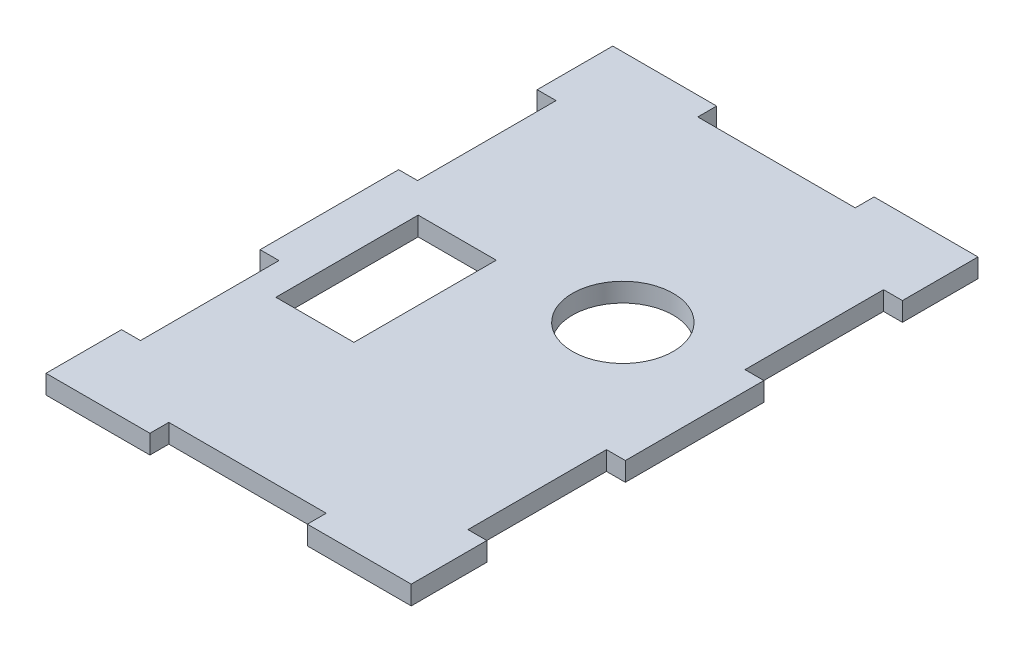
ISO-10303-21;
HEADER;
FILE_DESCRIPTION(('STEP AP214'),'2;1');
FILE_NAME('part.step','',(''),(''),'','','');
FILE_SCHEMA(('AUTOMOTIVE_DESIGN { 1 0 10303 214 1 1 1 1 }'));
ENDSEC;
DATA;
#1=APPLICATION_CONTEXT('core data for automotive mechanical design processes');
#2=APPLICATION_PROTOCOL_DEFINITION('international standard','automotive_design',2000,#1);
#3=PRODUCT_CONTEXT('',#1,'mechanical');
#4=PRODUCT('Part','Part','',(#3));
#5=PRODUCT_RELATED_PRODUCT_CATEGORY('part','',(#4));
#6=PRODUCT_DEFINITION_FORMATION('','',#4);
#7=PRODUCT_DEFINITION_CONTEXT('part definition',#1,'design');
#8=PRODUCT_DEFINITION('design','',#6,#7);
#9=PRODUCT_DEFINITION_SHAPE('','',#8);
#10=(LENGTH_UNIT() NAMED_UNIT(*) SI_UNIT(.MILLI.,.METRE.));
#11=(NAMED_UNIT(*) PLANE_ANGLE_UNIT() SI_UNIT($,.RADIAN.));
#12=(NAMED_UNIT(*) SI_UNIT($,.STERADIAN.) SOLID_ANGLE_UNIT());
#13=UNCERTAINTY_MEASURE_WITH_UNIT(LENGTH_MEASURE(1.E-05),#10,'distance_accuracy_value','');
#14=(GEOMETRIC_REPRESENTATION_CONTEXT(3) GLOBAL_UNCERTAINTY_ASSIGNED_CONTEXT((#13)) GLOBAL_UNIT_ASSIGNED_CONTEXT((#10,
#11,#12)) REPRESENTATION_CONTEXT('',''));
#15=CARTESIAN_POINT('',(0.,0.,0.));
#16=DIRECTION('',(0.,0.,1.));
#17=DIRECTION('',(1.,0.,0.));
#18=AXIS2_PLACEMENT_3D('',#15,#16,#17);
#19=CARTESIAN_POINT('',(0.,3.,0.));
#20=DIRECTION('',(0.,-1.,0.));
#21=DIRECTION('',(0.,0.,-1.));
#22=AXIS2_PLACEMENT_3D('',#19,#20,#21);
#23=PLANE('',#22);
#24=CARTESIAN_POINT('',(12.8024192368406,3.,37.2));
#25=DIRECTION('',(0.,1.,0.));
#26=DIRECTION('',(0.,0.,1.));
#27=AXIS2_PLACEMENT_3D('',#24,#25,#26);
#28=CIRCLE('',#27,8.);
#29=CARTESIAN_POINT('',(12.8024192368406,3.,45.2));
#30=VERTEX_POINT('',#29);
#31=EDGE_CURVE('E278',#30,#30,#28,.T.);
#32=ORIENTED_EDGE('',*,*,#31,.F.);
#33=EDGE_LOOP('',(#32));
#34=FACE_BOUND('',#33,.T.);
#35=DIRECTION('',(1.,0.,0.));
#36=VECTOR('',#35,1.);
#37=CARTESIAN_POINT('',(-26.,3.,12.));
#38=LINE('',#37,#36);
#39=CARTESIAN_POINT('',(-26.,3.,12.));
#40=VERTEX_POINT('',#39);
#41=CARTESIAN_POINT('',(-23.,3.,12.));
#42=VERTEX_POINT('',#41);
#43=EDGE_CURVE('E284',#40,#42,#38,.T.);
#44=ORIENTED_EDGE('',*,*,#43,.T.);
#45=DIRECTION('',(0.,0.,1.));
#46=VECTOR('',#45,1.);
#47=CARTESIAN_POINT('',(-23.,3.,12.));
#48=LINE('',#47,#46);
#49=CARTESIAN_POINT('',(-23.,3.,34.));
#50=VERTEX_POINT('',#49);
#51=EDGE_CURVE('E287',#42,#50,#48,.T.);
#52=ORIENTED_EDGE('',*,*,#51,.T.);
#53=DIRECTION('',(-1.,0.,0.));
#54=VECTOR('',#53,1.);
#55=CARTESIAN_POINT('',(-23.,3.,34.));
#56=LINE('',#55,#54);
#57=CARTESIAN_POINT('',(-26.,3.,34.));
#58=VERTEX_POINT('',#57);
#59=EDGE_CURVE('E290',#50,#58,#56,.T.);
#60=ORIENTED_EDGE('',*,*,#59,.T.);
#61=DIRECTION('',(0.,0.,1.));
#62=VECTOR('',#61,1.);
#63=CARTESIAN_POINT('',(-26.,3.,34.));
#64=LINE('',#63,#62);
#65=CARTESIAN_POINT('',(-26.,3.,56.));
#66=VERTEX_POINT('',#65);
#67=EDGE_CURVE('E292',#58,#66,#64,.T.);
#68=ORIENTED_EDGE('',*,*,#67,.T.);
#69=DIRECTION('',(1.,0.,0.));
#70=VECTOR('',#69,1.);
#71=CARTESIAN_POINT('',(-26.,3.,56.));
#72=LINE('',#71,#70);
#73=CARTESIAN_POINT('',(-23.,3.,56.));
#74=VERTEX_POINT('',#73);
#75=EDGE_CURVE('E294',#66,#74,#72,.T.);
#76=ORIENTED_EDGE('',*,*,#75,.T.);
#77=DIRECTION('',(0.,0.,1.));
#78=VECTOR('',#77,1.);
#79=CARTESIAN_POINT('',(-23.,3.,56.));
#80=LINE('',#79,#78);
#81=CARTESIAN_POINT('',(-23.,3.,78.));
#82=VERTEX_POINT('',#81);
#83=EDGE_CURVE('E296',#74,#82,#80,.T.);
#84=ORIENTED_EDGE('',*,*,#83,.T.);
#85=DIRECTION('',(-1.,0.,0.));
#86=VECTOR('',#85,1.);
#87=CARTESIAN_POINT('',(-23.,3.,78.));
#88=LINE('',#87,#86);
#89=CARTESIAN_POINT('',(-26.,3.,78.));
#90=VERTEX_POINT('',#89);
#91=EDGE_CURVE('E298',#82,#90,#88,.T.);
#92=ORIENTED_EDGE('',*,*,#91,.T.);
#93=DIRECTION('',(0.,0.,1.));
#94=VECTOR('',#93,1.);
#95=CARTESIAN_POINT('',(-26.,3.,78.));
#96=LINE('',#95,#94);
#97=CARTESIAN_POINT('',(-26.,3.,90.));
#98=VERTEX_POINT('',#97);
#99=EDGE_CURVE('E300',#90,#98,#96,.T.);
#100=ORIENTED_EDGE('',*,*,#99,.T.);
#101=DIRECTION('',(1.,0.,0.));
#102=VECTOR('',#101,1.);
#103=CARTESIAN_POINT('',(-26.,3.,90.));
#104=LINE('',#103,#102);
#105=CARTESIAN_POINT('',(-9.49999999999999,3.,90.));
#106=VERTEX_POINT('',#105);
#107=EDGE_CURVE('E302',#98,#106,#104,.T.);
#108=ORIENTED_EDGE('',*,*,#107,.T.);
#109=DIRECTION('',(0.,0.,-1.));
#110=VECTOR('',#109,1.);
#111=CARTESIAN_POINT('',(-9.49999999999999,3.,90.));
#112=LINE('',#111,#110);
#113=CARTESIAN_POINT('',(-9.5,3.,87.));
#114=VERTEX_POINT('',#113);
#115=EDGE_CURVE('E304',#106,#114,#112,.T.);
#116=ORIENTED_EDGE('',*,*,#115,.T.);
#117=DIRECTION('',(1.,0.,0.));
#118=VECTOR('',#117,1.);
#119=CARTESIAN_POINT('',(-9.5,3.,87.));
#120=LINE('',#119,#118);
#121=CARTESIAN_POINT('',(15.5,3.,87.));
#122=VERTEX_POINT('',#121);
#123=EDGE_CURVE('E306',#114,#122,#120,.T.);
#124=ORIENTED_EDGE('',*,*,#123,.T.);
#125=DIRECTION('',(0.,0.,1.));
#126=VECTOR('',#125,1.);
#127=CARTESIAN_POINT('',(15.5,3.,87.));
#128=LINE('',#127,#126);
#129=CARTESIAN_POINT('',(15.5,3.,90.));
#130=VERTEX_POINT('',#129);
#131=EDGE_CURVE('E308',#122,#130,#128,.T.);
#132=ORIENTED_EDGE('',*,*,#131,.T.);
#133=DIRECTION('',(1.,0.,0.));
#134=VECTOR('',#133,1.);
#135=CARTESIAN_POINT('',(15.5,3.,90.));
#136=LINE('',#135,#134);
#137=CARTESIAN_POINT('',(32.,3.,90.));
#138=VERTEX_POINT('',#137);
#139=EDGE_CURVE('E310',#130,#138,#136,.T.);
#140=ORIENTED_EDGE('',*,*,#139,.T.);
#141=DIRECTION('',(0.,0.,-1.));
#142=VECTOR('',#141,1.);
#143=CARTESIAN_POINT('',(32.,3.,78.));
#144=LINE('',#143,#142);
#145=CARTESIAN_POINT('',(32.,3.,78.));
#146=VERTEX_POINT('',#145);
#147=EDGE_CURVE('E312',#138,#146,#144,.T.);
#148=ORIENTED_EDGE('',*,*,#147,.T.);
#149=DIRECTION('',(-1.,0.,0.));
#150=VECTOR('',#149,1.);
#151=CARTESIAN_POINT('',(32.,3.,78.));
#152=LINE('',#151,#150);
#153=CARTESIAN_POINT('',(29.,3.,78.));
#154=VERTEX_POINT('',#153);
#155=EDGE_CURVE('E314',#146,#154,#152,.T.);
#156=ORIENTED_EDGE('',*,*,#155,.T.);
#157=DIRECTION('',(0.,0.,-1.));
#158=VECTOR('',#157,1.);
#159=CARTESIAN_POINT('',(29.,3.,78.));
#160=LINE('',#159,#158);
#161=CARTESIAN_POINT('',(29.,3.,56.));
#162=VERTEX_POINT('',#161);
#163=EDGE_CURVE('E316',#154,#162,#160,.T.);
#164=ORIENTED_EDGE('',*,*,#163,.T.);
#165=DIRECTION('',(1.,0.,0.));
#166=VECTOR('',#165,1.);
#167=CARTESIAN_POINT('',(29.,3.,56.));
#168=LINE('',#167,#166);
#169=CARTESIAN_POINT('',(32.,3.,56.));
#170=VERTEX_POINT('',#169);
#171=EDGE_CURVE('E318',#162,#170,#168,.T.);
#172=ORIENTED_EDGE('',*,*,#171,.T.);
#173=DIRECTION('',(0.,0.,-1.));
#174=VECTOR('',#173,1.);
#175=CARTESIAN_POINT('',(32.,3.,34.));
#176=LINE('',#175,#174);
#177=CARTESIAN_POINT('',(32.,3.,34.));
#178=VERTEX_POINT('',#177);
#179=EDGE_CURVE('E320',#170,#178,#176,.T.);
#180=ORIENTED_EDGE('',*,*,#179,.T.);
#181=DIRECTION('',(-1.,0.,0.));
#182=VECTOR('',#181,1.);
#183=CARTESIAN_POINT('',(29.,3.,34.));
#184=LINE('',#183,#182);
#185=CARTESIAN_POINT('',(29.,3.,34.));
#186=VERTEX_POINT('',#185);
#187=EDGE_CURVE('E322',#178,#186,#184,.T.);
#188=ORIENTED_EDGE('',*,*,#187,.T.);
#189=DIRECTION('',(0.,0.,-1.));
#190=VECTOR('',#189,1.);
#191=CARTESIAN_POINT('',(29.,3.,12.));
#192=LINE('',#191,#190);
#193=CARTESIAN_POINT('',(29.,3.,12.));
#194=VERTEX_POINT('',#193);
#195=EDGE_CURVE('E324',#186,#194,#192,.T.);
#196=ORIENTED_EDGE('',*,*,#195,.T.);
#197=DIRECTION('',(1.,0.,0.));
#198=VECTOR('',#197,1.);
#199=CARTESIAN_POINT('',(32.,3.,12.));
#200=LINE('',#199,#198);
#201=CARTESIAN_POINT('',(32.,3.,12.));
#202=VERTEX_POINT('',#201);
#203=EDGE_CURVE('E326',#194,#202,#200,.T.);
#204=ORIENTED_EDGE('',*,*,#203,.T.);
#205=DIRECTION('',(0.,0.,-1.));
#206=VECTOR('',#205,1.);
#207=CARTESIAN_POINT('',(32.,3.,0.));
#208=LINE('',#207,#206);
#209=CARTESIAN_POINT('',(32.,3.,0.));
#210=VERTEX_POINT('',#209);
#211=EDGE_CURVE('E328',#202,#210,#208,.T.);
#212=ORIENTED_EDGE('',*,*,#211,.T.);
#213=DIRECTION('',(-1.,0.,0.));
#214=VECTOR('',#213,1.);
#215=CARTESIAN_POINT('',(15.5,3.,0.));
#216=LINE('',#215,#214);
#217=CARTESIAN_POINT('',(15.5,3.,0.));
#218=VERTEX_POINT('',#217);
#219=EDGE_CURVE('E330',#210,#218,#216,.T.);
#220=ORIENTED_EDGE('',*,*,#219,.T.);
#221=DIRECTION('',(0.,0.,1.));
#222=VECTOR('',#221,1.);
#223=CARTESIAN_POINT('',(15.5,3.,3.));
#224=LINE('',#223,#222);
#225=CARTESIAN_POINT('',(15.5,3.,3.));
#226=VERTEX_POINT('',#225);
#227=EDGE_CURVE('E332',#218,#226,#224,.T.);
#228=ORIENTED_EDGE('',*,*,#227,.T.);
#229=DIRECTION('',(-1.,0.,0.));
#230=VECTOR('',#229,1.);
#231=CARTESIAN_POINT('',(-9.5,3.,3.));
#232=LINE('',#231,#230);
#233=CARTESIAN_POINT('',(-9.5,3.,3.));
#234=VERTEX_POINT('',#233);
#235=EDGE_CURVE('E334',#226,#234,#232,.T.);
#236=ORIENTED_EDGE('',*,*,#235,.T.);
#237=DIRECTION('',(0.,0.,-1.));
#238=VECTOR('',#237,1.);
#239=CARTESIAN_POINT('',(-9.5,3.,0.));
#240=LINE('',#239,#238);
#241=CARTESIAN_POINT('',(-9.5,3.,0.));
#242=VERTEX_POINT('',#241);
#243=EDGE_CURVE('E336',#234,#242,#240,.T.);
#244=ORIENTED_EDGE('',*,*,#243,.T.);
#245=DIRECTION('',(-1.,0.,0.));
#246=VECTOR('',#245,1.);
#247=CARTESIAN_POINT('',(-26.,3.,0.));
#248=LINE('',#247,#246);
#249=CARTESIAN_POINT('',(-26.,3.,0.));
#250=VERTEX_POINT('',#249);
#251=EDGE_CURVE('E338',#242,#250,#248,.T.);
#252=ORIENTED_EDGE('',*,*,#251,.T.);
#253=DIRECTION('',(0.,0.,1.));
#254=VECTOR('',#253,1.);
#255=CARTESIAN_POINT('',(-26.,3.,0.));
#256=LINE('',#255,#254);
#257=EDGE_CURVE('E340',#250,#40,#256,.T.);
#258=ORIENTED_EDGE('',*,*,#257,.T.);
#259=EDGE_LOOP('',(#44,#52,#60,#68,#76,#84,#92,#100,#108,#116,#124,#132,#140,#148,#156,#164,
#172,#180,#188,#196,#204,#212,#220,#228,#236,#244,#252,#258));
#260=FACE_BOUND('',#259,.T.);
#261=DIRECTION('',(0.,0.,1.));
#262=VECTOR('',#261,1.);
#263=CARTESIAN_POINT('',(-18.2,3.,38.7));
#264=LINE('',#263,#262);
#265=CARTESIAN_POINT('',(-18.2,3.,38.7));
#266=VERTEX_POINT('',#265);
#267=CARTESIAN_POINT('',(-18.2,3.,61.3));
#268=VERTEX_POINT('',#267);
#269=EDGE_CURVE('E242',#266,#268,#264,.T.);
#270=ORIENTED_EDGE('',*,*,#269,.F.);
#271=DIRECTION('',(-1.,0.,0.));
#272=VECTOR('',#271,1.);
#273=CARTESIAN_POINT('',(-5.79999999999999,3.,38.7));
#274=LINE('',#273,#272);
#275=CARTESIAN_POINT('',(-5.79999999999999,3.,38.7));
#276=VERTEX_POINT('',#275);
#277=EDGE_CURVE('E264',#276,#266,#274,.T.);
#278=ORIENTED_EDGE('',*,*,#277,.F.);
#279=DIRECTION('',(0.,0.,-1.));
#280=VECTOR('',#279,1.);
#281=CARTESIAN_POINT('',(-5.79999999999999,3.,61.3));
#282=LINE('',#281,#280);
#283=CARTESIAN_POINT('',(-5.79999999999999,3.,61.3));
#284=VERTEX_POINT('',#283);
#285=EDGE_CURVE('E262',#284,#276,#282,.T.);
#286=ORIENTED_EDGE('',*,*,#285,.F.);
#287=DIRECTION('',(1.,0.,0.));
#288=VECTOR('',#287,1.);
#289=CARTESIAN_POINT('',(-18.2,3.,61.3));
#290=LINE('',#289,#288);
#291=EDGE_CURVE('E250',#268,#284,#290,.T.);
#292=ORIENTED_EDGE('',*,*,#291,.F.);
#293=EDGE_LOOP('',(#270,#278,#286,#292));
#294=FACE_BOUND('',#293,.T.);
#295=ADVANCED_FACE('F33',(#34,#260,#294),#23,.F.);
#296=CARTESIAN_POINT('',(0.,0.,0.));
#297=DIRECTION('',(0.,-1.,0.));
#298=DIRECTION('',(0.,0.,-1.));
#299=AXIS2_PLACEMENT_3D('',#296,#297,#298);
#300=PLANE('',#299);
#301=DIRECTION('',(1.,0.,0.));
#302=VECTOR('',#301,1.);
#303=CARTESIAN_POINT('',(-26.,0.,12.));
#304=LINE('',#303,#302);
#305=CARTESIAN_POINT('',(-26.,0.,12.));
#306=VERTEX_POINT('',#305);
#307=CARTESIAN_POINT('',(-23.,0.,12.));
#308=VERTEX_POINT('',#307);
#309=EDGE_CURVE('E281',#306,#308,#304,.T.);
#310=ORIENTED_EDGE('',*,*,#309,.F.);
#311=DIRECTION('',(0.,0.,1.));
#312=VECTOR('',#311,1.);
#313=CARTESIAN_POINT('',(-26.,0.,0.));
#314=LINE('',#313,#312);
#315=CARTESIAN_POINT('',(-26.,0.,0.));
#316=VERTEX_POINT('',#315);
#317=EDGE_CURVE('E288',#316,#306,#314,.T.);
#318=ORIENTED_EDGE('',*,*,#317,.F.);
#319=DIRECTION('',(-1.,0.,0.));
#320=VECTOR('',#319,1.);
#321=CARTESIAN_POINT('',(-26.,0.,0.));
#322=LINE('',#321,#320);
#323=CARTESIAN_POINT('',(-9.5,0.,0.));
#324=VERTEX_POINT('',#323);
#325=EDGE_CURVE('E395',#324,#316,#322,.T.);
#326=ORIENTED_EDGE('',*,*,#325,.F.);
#327=DIRECTION('',(0.,0.,-1.));
#328=VECTOR('',#327,1.);
#329=CARTESIAN_POINT('',(-9.5,0.,0.));
#330=LINE('',#329,#328);
#331=CARTESIAN_POINT('',(-9.5,0.,3.));
#332=VERTEX_POINT('',#331);
#333=EDGE_CURVE('E393',#332,#324,#330,.T.);
#334=ORIENTED_EDGE('',*,*,#333,.F.);
#335=DIRECTION('',(-1.,0.,0.));
#336=VECTOR('',#335,1.);
#337=CARTESIAN_POINT('',(-9.5,0.,3.));
#338=LINE('',#337,#336);
#339=CARTESIAN_POINT('',(15.5,0.,3.));
#340=VERTEX_POINT('',#339);
#341=EDGE_CURVE('E391',#340,#332,#338,.T.);
#342=ORIENTED_EDGE('',*,*,#341,.F.);
#343=DIRECTION('',(0.,0.,1.));
#344=VECTOR('',#343,1.);
#345=CARTESIAN_POINT('',(15.5,0.,3.));
#346=LINE('',#345,#344);
#347=CARTESIAN_POINT('',(15.5,0.,0.));
#348=VERTEX_POINT('',#347);
#349=EDGE_CURVE('E389',#348,#340,#346,.T.);
#350=ORIENTED_EDGE('',*,*,#349,.F.);
#351=DIRECTION('',(-1.,0.,0.));
#352=VECTOR('',#351,1.);
#353=CARTESIAN_POINT('',(15.5,0.,0.));
#354=LINE('',#353,#352);
#355=CARTESIAN_POINT('',(32.,0.,0.));
#356=VERTEX_POINT('',#355);
#357=EDGE_CURVE('E387',#356,#348,#354,.T.);
#358=ORIENTED_EDGE('',*,*,#357,.F.);
#359=DIRECTION('',(0.,0.,-1.));
#360=VECTOR('',#359,1.);
#361=CARTESIAN_POINT('',(32.,0.,0.));
#362=LINE('',#361,#360);
#363=CARTESIAN_POINT('',(32.,0.,12.));
#364=VERTEX_POINT('',#363);
#365=EDGE_CURVE('E385',#364,#356,#362,.T.);
#366=ORIENTED_EDGE('',*,*,#365,.F.);
#367=DIRECTION('',(1.,0.,0.));
#368=VECTOR('',#367,1.);
#369=CARTESIAN_POINT('',(32.,0.,12.));
#370=LINE('',#369,#368);
#371=CARTESIAN_POINT('',(29.,0.,12.));
#372=VERTEX_POINT('',#371);
#373=EDGE_CURVE('E383',#372,#364,#370,.T.);
#374=ORIENTED_EDGE('',*,*,#373,.F.);
#375=DIRECTION('',(0.,0.,-1.));
#376=VECTOR('',#375,1.);
#377=CARTESIAN_POINT('',(29.,0.,12.));
#378=LINE('',#377,#376);
#379=CARTESIAN_POINT('',(29.,0.,34.));
#380=VERTEX_POINT('',#379);
#381=EDGE_CURVE('E381',#380,#372,#378,.T.);
#382=ORIENTED_EDGE('',*,*,#381,.F.);
#383=DIRECTION('',(-1.,0.,0.));
#384=VECTOR('',#383,1.);
#385=CARTESIAN_POINT('',(29.,0.,34.));
#386=LINE('',#385,#384);
#387=CARTESIAN_POINT('',(32.,0.,34.));
#388=VERTEX_POINT('',#387);
#389=EDGE_CURVE('E379',#388,#380,#386,.T.);
#390=ORIENTED_EDGE('',*,*,#389,.F.);
#391=DIRECTION('',(0.,0.,-1.));
#392=VECTOR('',#391,1.);
#393=CARTESIAN_POINT('',(32.,0.,34.));
#394=LINE('',#393,#392);
#395=CARTESIAN_POINT('',(32.,0.,56.));
#396=VERTEX_POINT('',#395);
#397=EDGE_CURVE('E377',#396,#388,#394,.T.);
#398=ORIENTED_EDGE('',*,*,#397,.F.);
#399=DIRECTION('',(1.,0.,0.));
#400=VECTOR('',#399,1.);
#401=CARTESIAN_POINT('',(29.,0.,56.));
#402=LINE('',#401,#400);
#403=CARTESIAN_POINT('',(29.,0.,56.));
#404=VERTEX_POINT('',#403);
#405=EDGE_CURVE('E375',#404,#396,#402,.T.);
#406=ORIENTED_EDGE('',*,*,#405,.F.);
#407=DIRECTION('',(0.,0.,-1.));
#408=VECTOR('',#407,1.);
#409=CARTESIAN_POINT('',(29.,0.,78.));
#410=LINE('',#409,#408);
#411=CARTESIAN_POINT('',(29.,0.,78.));
#412=VERTEX_POINT('',#411);
#413=EDGE_CURVE('E373',#412,#404,#410,.T.);
#414=ORIENTED_EDGE('',*,*,#413,.F.);
#415=DIRECTION('',(-1.,0.,0.));
#416=VECTOR('',#415,1.);
#417=CARTESIAN_POINT('',(32.,0.,78.));
#418=LINE('',#417,#416);
#419=CARTESIAN_POINT('',(32.,0.,78.));
#420=VERTEX_POINT('',#419);
#421=EDGE_CURVE('E371',#420,#412,#418,.T.);
#422=ORIENTED_EDGE('',*,*,#421,.F.);
#423=DIRECTION('',(0.,0.,-1.));
#424=VECTOR('',#423,1.);
#425=CARTESIAN_POINT('',(32.,0.,78.));
#426=LINE('',#425,#424);
#427=CARTESIAN_POINT('',(32.,0.,90.));
#428=VERTEX_POINT('',#427);
#429=EDGE_CURVE('E369',#428,#420,#426,.T.);
#430=ORIENTED_EDGE('',*,*,#429,.F.);
#431=DIRECTION('',(1.,0.,0.));
#432=VECTOR('',#431,1.);
#433=CARTESIAN_POINT('',(15.5,0.,90.));
#434=LINE('',#433,#432);
#435=CARTESIAN_POINT('',(15.5,0.,90.));
#436=VERTEX_POINT('',#435);
#437=EDGE_CURVE('E367',#436,#428,#434,.T.);
#438=ORIENTED_EDGE('',*,*,#437,.F.);
#439=DIRECTION('',(0.,0.,1.));
#440=VECTOR('',#439,1.);
#441=CARTESIAN_POINT('',(15.5,0.,87.));
#442=LINE('',#441,#440);
#443=CARTESIAN_POINT('',(15.5,0.,87.));
#444=VERTEX_POINT('',#443);
#445=EDGE_CURVE('E365',#444,#436,#442,.T.);
#446=ORIENTED_EDGE('',*,*,#445,.F.);
#447=DIRECTION('',(1.,0.,0.));
#448=VECTOR('',#447,1.);
#449=CARTESIAN_POINT('',(-9.5,0.,87.));
#450=LINE('',#449,#448);
#451=CARTESIAN_POINT('',(-9.5,0.,87.));
#452=VERTEX_POINT('',#451);
#453=EDGE_CURVE('E363',#452,#444,#450,.T.);
#454=ORIENTED_EDGE('',*,*,#453,.F.);
#455=DIRECTION('',(0.,0.,-1.));
#456=VECTOR('',#455,1.);
#457=CARTESIAN_POINT('',(-9.49999999999999,0.,90.));
#458=LINE('',#457,#456);
#459=CARTESIAN_POINT('',(-9.49999999999999,0.,90.));
#460=VERTEX_POINT('',#459);
#461=EDGE_CURVE('E361',#460,#452,#458,.T.);
#462=ORIENTED_EDGE('',*,*,#461,.F.);
#463=DIRECTION('',(1.,0.,0.));
#464=VECTOR('',#463,1.);
#465=CARTESIAN_POINT('',(-26.,0.,90.));
#466=LINE('',#465,#464);
#467=CARTESIAN_POINT('',(-26.,0.,90.));
#468=VERTEX_POINT('',#467);
#469=EDGE_CURVE('E359',#468,#460,#466,.T.);
#470=ORIENTED_EDGE('',*,*,#469,.F.);
#471=DIRECTION('',(0.,0.,1.));
#472=VECTOR('',#471,1.);
#473=CARTESIAN_POINT('',(-26.,0.,78.));
#474=LINE('',#473,#472);
#475=CARTESIAN_POINT('',(-26.,0.,78.));
#476=VERTEX_POINT('',#475);
#477=EDGE_CURVE('E357',#476,#468,#474,.T.);
#478=ORIENTED_EDGE('',*,*,#477,.F.);
#479=DIRECTION('',(-1.,0.,0.));
#480=VECTOR('',#479,1.);
#481=CARTESIAN_POINT('',(-23.,0.,78.));
#482=LINE('',#481,#480);
#483=CARTESIAN_POINT('',(-23.,0.,78.));
#484=VERTEX_POINT('',#483);
#485=EDGE_CURVE('E355',#484,#476,#482,.T.);
#486=ORIENTED_EDGE('',*,*,#485,.F.);
#487=DIRECTION('',(0.,0.,1.));
#488=VECTOR('',#487,1.);
#489=CARTESIAN_POINT('',(-23.,0.,56.));
#490=LINE('',#489,#488);
#491=CARTESIAN_POINT('',(-23.,0.,56.));
#492=VERTEX_POINT('',#491);
#493=EDGE_CURVE('E353',#492,#484,#490,.T.);
#494=ORIENTED_EDGE('',*,*,#493,.F.);
#495=DIRECTION('',(1.,0.,0.));
#496=VECTOR('',#495,1.);
#497=CARTESIAN_POINT('',(-26.,0.,56.));
#498=LINE('',#497,#496);
#499=CARTESIAN_POINT('',(-26.,0.,56.));
#500=VERTEX_POINT('',#499);
#501=EDGE_CURVE('E351',#500,#492,#498,.T.);
#502=ORIENTED_EDGE('',*,*,#501,.F.);
#503=DIRECTION('',(0.,0.,1.));
#504=VECTOR('',#503,1.);
#505=CARTESIAN_POINT('',(-26.,0.,34.));
#506=LINE('',#505,#504);
#507=CARTESIAN_POINT('',(-26.,0.,34.));
#508=VERTEX_POINT('',#507);
#509=EDGE_CURVE('E349',#508,#500,#506,.T.);
#510=ORIENTED_EDGE('',*,*,#509,.F.);
#511=DIRECTION('',(-1.,0.,0.));
#512=VECTOR('',#511,1.);
#513=CARTESIAN_POINT('',(-23.,0.,34.));
#514=LINE('',#513,#512);
#515=CARTESIAN_POINT('',(-23.,0.,34.));
#516=VERTEX_POINT('',#515);
#517=EDGE_CURVE('E347',#516,#508,#514,.T.);
#518=ORIENTED_EDGE('',*,*,#517,.F.);
#519=DIRECTION('',(0.,0.,1.));
#520=VECTOR('',#519,1.);
#521=CARTESIAN_POINT('',(-23.,0.,12.));
#522=LINE('',#521,#520);
#523=EDGE_CURVE('E345',#308,#516,#522,.T.);
#524=ORIENTED_EDGE('',*,*,#523,.F.);
#525=EDGE_LOOP('',(#310,#318,#326,#334,#342,#350,#358,#366,#374,#382,#390,#398,#406,#414,#422,
#430,#438,#446,#454,#462,#470,#478,#486,#494,#502,#510,#518,#524));
#526=FACE_BOUND('',#525,.T.);
#527=CARTESIAN_POINT('',(12.8024192368406,0.,37.2));
#528=DIRECTION('',(0.,1.,0.));
#529=DIRECTION('',(0.,0.,1.));
#530=AXIS2_PLACEMENT_3D('',#527,#528,#529);
#531=CIRCLE('',#530,8.);
#532=CARTESIAN_POINT('',(12.8024192368406,0.,45.2));
#533=VERTEX_POINT('',#532);
#534=EDGE_CURVE('E258',#533,#533,#531,.T.);
#535=ORIENTED_EDGE('',*,*,#534,.T.);
#536=EDGE_LOOP('',(#535));
#537=FACE_BOUND('',#536,.T.);
#538=DIRECTION('',(-1.,0.,0.));
#539=VECTOR('',#538,1.);
#540=CARTESIAN_POINT('',(-5.79999999999999,0.,38.7));
#541=LINE('',#540,#539);
#542=CARTESIAN_POINT('',(-5.79999999999999,0.,38.7));
#543=VERTEX_POINT('',#542);
#544=CARTESIAN_POINT('',(-18.2,0.,38.7));
#545=VERTEX_POINT('',#544);
#546=EDGE_CURVE('E251',#543,#545,#541,.T.);
#547=ORIENTED_EDGE('',*,*,#546,.T.);
#548=DIRECTION('',(0.,0.,1.));
#549=VECTOR('',#548,1.);
#550=CARTESIAN_POINT('',(-18.2,0.,38.7));
#551=LINE('',#550,#549);
#552=CARTESIAN_POINT('',(-18.2,0.,61.3));
#553=VERTEX_POINT('',#552);
#554=EDGE_CURVE('E56',#545,#553,#551,.T.);
#555=ORIENTED_EDGE('',*,*,#554,.T.);
#556=DIRECTION('',(1.,0.,0.));
#557=VECTOR('',#556,1.);
#558=CARTESIAN_POINT('',(-18.2,0.,61.3));
#559=LINE('',#558,#557);
#560=CARTESIAN_POINT('',(-5.79999999999999,0.,61.3));
#561=VERTEX_POINT('',#560);
#562=EDGE_CURVE('E257',#553,#561,#559,.T.);
#563=ORIENTED_EDGE('',*,*,#562,.T.);
#564=DIRECTION('',(0.,0.,-1.));
#565=VECTOR('',#564,1.);
#566=CARTESIAN_POINT('',(-5.79999999999999,0.,61.3));
#567=LINE('',#566,#565);
#568=EDGE_CURVE('E270',#561,#543,#567,.T.);
#569=ORIENTED_EDGE('',*,*,#568,.T.);
#570=EDGE_LOOP('',(#547,#555,#563,#569));
#571=FACE_BOUND('',#570,.T.);
#572=ADVANCED_FACE('F485',(#526,#537,#571),#300,.T.);
#573=CARTESIAN_POINT('',(-26.,3.,12.));
#574=DIRECTION('',(0.,0.,-1.));
#575=DIRECTION('',(-1.,0.,0.));
#576=AXIS2_PLACEMENT_3D('',#573,#574,#575);
#577=PLANE('',#576);
#578=ORIENTED_EDGE('',*,*,#309,.T.);
#579=DIRECTION('',(0.,-1.,0.));
#580=VECTOR('',#579,1.);
#581=CARTESIAN_POINT('',(-23.,3.,12.));
#582=LINE('',#581,#580);
#583=EDGE_CURVE('E11',#42,#308,#582,.T.);
#584=ORIENTED_EDGE('',*,*,#583,.F.);
#585=ORIENTED_EDGE('',*,*,#43,.F.);
#586=DIRECTION('',(0.,-1.,0.));
#587=VECTOR('',#586,1.);
#588=CARTESIAN_POINT('',(-26.,3.,12.));
#589=LINE('',#588,#587);
#590=EDGE_CURVE('E342',#40,#306,#589,.T.);
#591=ORIENTED_EDGE('',*,*,#590,.T.);
#592=EDGE_LOOP('',(#578,#584,#585,#591));
#593=FACE_BOUND('',#592,.T.);
#594=ADVANCED_FACE('F35',(#593),#577,.F.);
#595=CARTESIAN_POINT('',(-23.,3.,12.));
#596=DIRECTION('',(1.,0.,0.));
#597=DIRECTION('',(0.,0.,-1.));
#598=AXIS2_PLACEMENT_3D('',#595,#596,#597);
#599=PLANE('',#598);
#600=ORIENTED_EDGE('',*,*,#523,.T.);
#601=DIRECTION('',(0.,-1.,0.));
#602=VECTOR('',#601,1.);
#603=CARTESIAN_POINT('',(-23.,3.,34.));
#604=LINE('',#603,#602);
#605=EDGE_CURVE('E41',#50,#516,#604,.T.);
#606=ORIENTED_EDGE('',*,*,#605,.F.);
#607=ORIENTED_EDGE('',*,*,#51,.F.);
#608=ORIENTED_EDGE('',*,*,#583,.T.);
#609=EDGE_LOOP('',(#600,#606,#607,#608));
#610=FACE_BOUND('',#609,.T.);
#611=ADVANCED_FACE('F502',(#610),#599,.F.);
#612=CARTESIAN_POINT('',(-23.,3.,34.));
#613=DIRECTION('',(0.,0.,1.));
#614=DIRECTION('',(1.,0.,0.));
#615=AXIS2_PLACEMENT_3D('',#612,#613,#614);
#616=PLANE('',#615);
#617=ORIENTED_EDGE('',*,*,#517,.T.);
#618=DIRECTION('',(0.,-1.,0.));
#619=VECTOR('',#618,1.);
#620=CARTESIAN_POINT('',(-26.,3.,34.));
#621=LINE('',#620,#619);
#622=EDGE_CURVE('E472',#58,#508,#621,.T.);
#623=ORIENTED_EDGE('',*,*,#622,.F.);
#624=ORIENTED_EDGE('',*,*,#59,.F.);
#625=ORIENTED_EDGE('',*,*,#605,.T.);
#626=EDGE_LOOP('',(#617,#623,#624,#625));
#627=FACE_BOUND('',#626,.T.);
#628=ADVANCED_FACE('F479',(#627),#616,.F.);
#629=CARTESIAN_POINT('',(-26.,3.,34.));
#630=DIRECTION('',(1.,0.,0.));
#631=DIRECTION('',(0.,0.,-1.));
#632=AXIS2_PLACEMENT_3D('',#629,#630,#631);
#633=PLANE('',#632);
#634=ORIENTED_EDGE('',*,*,#509,.T.);
#635=DIRECTION('',(0.,-1.,0.));
#636=VECTOR('',#635,1.);
#637=CARTESIAN_POINT('',(-26.,3.,56.));
#638=LINE('',#637,#636);
#639=EDGE_CURVE('E469',#66,#500,#638,.T.);
#640=ORIENTED_EDGE('',*,*,#639,.F.);
#641=ORIENTED_EDGE('',*,*,#67,.F.);
#642=ORIENTED_EDGE('',*,*,#622,.T.);
#643=EDGE_LOOP('',(#634,#640,#641,#642));
#644=FACE_BOUND('',#643,.T.);
#645=ADVANCED_FACE('F491',(#644),#633,.F.);
#646=CARTESIAN_POINT('',(-26.,3.,56.));
#647=DIRECTION('',(0.,0.,-1.));
#648=DIRECTION('',(-1.,0.,0.));
#649=AXIS2_PLACEMENT_3D('',#646,#647,#648);
#650=PLANE('',#649);
#651=ORIENTED_EDGE('',*,*,#501,.T.);
#652=DIRECTION('',(0.,-1.,0.));
#653=VECTOR('',#652,1.);
#654=CARTESIAN_POINT('',(-23.,3.,56.));
#655=LINE('',#654,#653);
#656=EDGE_CURVE('E466',#74,#492,#655,.T.);
#657=ORIENTED_EDGE('',*,*,#656,.F.);
#658=ORIENTED_EDGE('',*,*,#75,.F.);
#659=ORIENTED_EDGE('',*,*,#639,.T.);
#660=EDGE_LOOP('',(#651,#657,#658,#659));
#661=FACE_BOUND('',#660,.T.);
#662=ADVANCED_FACE('F495',(#661),#650,.F.);
#663=CARTESIAN_POINT('',(-23.,3.,56.));
#664=DIRECTION('',(1.,0.,0.));
#665=DIRECTION('',(0.,0.,-1.));
#666=AXIS2_PLACEMENT_3D('',#663,#664,#665);
#667=PLANE('',#666);
#668=ORIENTED_EDGE('',*,*,#493,.T.);
#669=DIRECTION('',(0.,-1.,0.));
#670=VECTOR('',#669,1.);
#671=CARTESIAN_POINT('',(-23.,3.,78.));
#672=LINE('',#671,#670);
#673=EDGE_CURVE('E463',#82,#484,#672,.T.);
#674=ORIENTED_EDGE('',*,*,#673,.F.);
#675=ORIENTED_EDGE('',*,*,#83,.F.);
#676=ORIENTED_EDGE('',*,*,#656,.T.);
#677=EDGE_LOOP('',(#668,#674,#675,#676));
#678=FACE_BOUND('',#677,.T.);
#679=ADVANCED_FACE('F615',(#678),#667,.F.);
#680=CARTESIAN_POINT('',(-23.,3.,78.));
#681=DIRECTION('',(0.,0.,1.));
#682=DIRECTION('',(1.,0.,0.));
#683=AXIS2_PLACEMENT_3D('',#680,#681,#682);
#684=PLANE('',#683);
#685=ORIENTED_EDGE('',*,*,#485,.T.);
#686=DIRECTION('',(0.,-1.,0.));
#687=VECTOR('',#686,1.);
#688=CARTESIAN_POINT('',(-26.,3.,78.));
#689=LINE('',#688,#687);
#690=EDGE_CURVE('E460',#90,#476,#689,.T.);
#691=ORIENTED_EDGE('',*,*,#690,.F.);
#692=ORIENTED_EDGE('',*,*,#91,.F.);
#693=ORIENTED_EDGE('',*,*,#673,.T.);
#694=EDGE_LOOP('',(#685,#691,#692,#693));
#695=FACE_BOUND('',#694,.T.);
#696=ADVANCED_FACE('F612',(#695),#684,.F.);
#697=CARTESIAN_POINT('',(-26.,3.,78.));
#698=DIRECTION('',(1.,0.,0.));
#699=DIRECTION('',(0.,0.,-1.));
#700=AXIS2_PLACEMENT_3D('',#697,#698,#699);
#701=PLANE('',#700);
#702=ORIENTED_EDGE('',*,*,#477,.T.);
#703=DIRECTION('',(0.,-1.,0.));
#704=VECTOR('',#703,1.);
#705=CARTESIAN_POINT('',(-26.,3.,90.));
#706=LINE('',#705,#704);
#707=EDGE_CURVE('E457',#98,#468,#706,.T.);
#708=ORIENTED_EDGE('',*,*,#707,.F.);
#709=ORIENTED_EDGE('',*,*,#99,.F.);
#710=ORIENTED_EDGE('',*,*,#690,.T.);
#711=EDGE_LOOP('',(#702,#708,#709,#710));
#712=FACE_BOUND('',#711,.T.);
#713=ADVANCED_FACE('F608',(#712),#701,.F.);
#714=CARTESIAN_POINT('',(-26.,3.,90.));
#715=DIRECTION('',(0.,0.,-1.));
#716=DIRECTION('',(-1.,0.,0.));
#717=AXIS2_PLACEMENT_3D('',#714,#715,#716);
#718=PLANE('',#717);
#719=ORIENTED_EDGE('',*,*,#469,.T.);
#720=DIRECTION('',(0.,-1.,0.));
#721=VECTOR('',#720,1.);
#722=CARTESIAN_POINT('',(-9.49999999999999,3.,90.));
#723=LINE('',#722,#721);
#724=EDGE_CURVE('E454',#106,#460,#723,.T.);
#725=ORIENTED_EDGE('',*,*,#724,.F.);
#726=ORIENTED_EDGE('',*,*,#107,.F.);
#727=ORIENTED_EDGE('',*,*,#707,.T.);
#728=EDGE_LOOP('',(#719,#725,#726,#727));
#729=FACE_BOUND('',#728,.T.);
#730=ADVANCED_FACE('F604',(#729),#718,.F.);
#731=CARTESIAN_POINT('',(-9.49999999999999,3.,90.));
#732=DIRECTION('',(-1.,0.,0.));
#733=DIRECTION('',(0.,0.,1.));
#734=AXIS2_PLACEMENT_3D('',#731,#732,#733);
#735=PLANE('',#734);
#736=ORIENTED_EDGE('',*,*,#461,.T.);
#737=DIRECTION('',(0.,-1.,0.));
#738=VECTOR('',#737,1.);
#739=CARTESIAN_POINT('',(-9.5,3.,87.));
#740=LINE('',#739,#738);
#741=EDGE_CURVE('E451',#114,#452,#740,.T.);
#742=ORIENTED_EDGE('',*,*,#741,.F.);
#743=ORIENTED_EDGE('',*,*,#115,.F.);
#744=ORIENTED_EDGE('',*,*,#724,.T.);
#745=EDGE_LOOP('',(#736,#742,#743,#744));
#746=FACE_BOUND('',#745,.T.);
#747=ADVANCED_FACE('F599',(#746),#735,.F.);
#748=CARTESIAN_POINT('',(-9.5,3.,87.));
#749=DIRECTION('',(0.,0.,-1.));
#750=DIRECTION('',(-1.,0.,0.));
#751=AXIS2_PLACEMENT_3D('',#748,#749,#750);
#752=PLANE('',#751);
#753=ORIENTED_EDGE('',*,*,#453,.T.);
#754=DIRECTION('',(0.,-1.,0.));
#755=VECTOR('',#754,1.);
#756=CARTESIAN_POINT('',(15.5,3.,87.));
#757=LINE('',#756,#755);
#758=EDGE_CURVE('E448',#122,#444,#757,.T.);
#759=ORIENTED_EDGE('',*,*,#758,.F.);
#760=ORIENTED_EDGE('',*,*,#123,.F.);
#761=ORIENTED_EDGE('',*,*,#741,.T.);
#762=EDGE_LOOP('',(#753,#759,#760,#761));
#763=FACE_BOUND('',#762,.T.);
#764=ADVANCED_FACE('F593',(#763),#752,.F.);
#765=CARTESIAN_POINT('',(15.5,3.,87.));
#766=DIRECTION('',(1.,0.,0.));
#767=DIRECTION('',(0.,0.,-1.));
#768=AXIS2_PLACEMENT_3D('',#765,#766,#767);
#769=PLANE('',#768);
#770=ORIENTED_EDGE('',*,*,#445,.T.);
#771=DIRECTION('',(0.,-1.,0.));
#772=VECTOR('',#771,1.);
#773=CARTESIAN_POINT('',(15.5,3.,90.));
#774=LINE('',#773,#772);
#775=EDGE_CURVE('E445',#130,#436,#774,.T.);
#776=ORIENTED_EDGE('',*,*,#775,.F.);
#777=ORIENTED_EDGE('',*,*,#131,.F.);
#778=ORIENTED_EDGE('',*,*,#758,.T.);
#779=EDGE_LOOP('',(#770,#776,#777,#778));
#780=FACE_BOUND('',#779,.T.);
#781=ADVANCED_FACE('F589',(#780),#769,.F.);
#782=CARTESIAN_POINT('',(15.5,3.,90.));
#783=DIRECTION('',(0.,0.,-1.));
#784=DIRECTION('',(-1.,0.,0.));
#785=AXIS2_PLACEMENT_3D('',#782,#783,#784);
#786=PLANE('',#785);
#787=ORIENTED_EDGE('',*,*,#437,.T.);
#788=DIRECTION('',(0.,-1.,0.));
#789=VECTOR('',#788,1.);
#790=CARTESIAN_POINT('',(32.,3.,90.));
#791=LINE('',#790,#789);
#792=EDGE_CURVE('E442',#138,#428,#791,.T.);
#793=ORIENTED_EDGE('',*,*,#792,.F.);
#794=ORIENTED_EDGE('',*,*,#139,.F.);
#795=ORIENTED_EDGE('',*,*,#775,.T.);
#796=EDGE_LOOP('',(#787,#793,#794,#795));
#797=FACE_BOUND('',#796,.T.);
#798=ADVANCED_FACE('F584',(#797),#786,.F.);
#799=CARTESIAN_POINT('',(32.,3.,78.));
#800=DIRECTION('',(-1.,0.,0.));
#801=DIRECTION('',(0.,0.,1.));
#802=AXIS2_PLACEMENT_3D('',#799,#800,#801);
#803=PLANE('',#802);
#804=ORIENTED_EDGE('',*,*,#429,.T.);
#805=DIRECTION('',(0.,-1.,0.));
#806=VECTOR('',#805,1.);
#807=CARTESIAN_POINT('',(32.,3.,78.));
#808=LINE('',#807,#806);
#809=EDGE_CURVE('E439',#146,#420,#808,.T.);
#810=ORIENTED_EDGE('',*,*,#809,.F.);
#811=ORIENTED_EDGE('',*,*,#147,.F.);
#812=ORIENTED_EDGE('',*,*,#792,.T.);
#813=EDGE_LOOP('',(#804,#810,#811,#812));
#814=FACE_BOUND('',#813,.T.);
#815=ADVANCED_FACE('F578',(#814),#803,.F.);
#816=CARTESIAN_POINT('',(32.,3.,78.));
#817=DIRECTION('',(0.,0.,1.));
#818=DIRECTION('',(1.,0.,0.));
#819=AXIS2_PLACEMENT_3D('',#816,#817,#818);
#820=PLANE('',#819);
#821=ORIENTED_EDGE('',*,*,#421,.T.);
#822=DIRECTION('',(0.,-1.,0.));
#823=VECTOR('',#822,1.);
#824=CARTESIAN_POINT('',(29.,3.,78.));
#825=LINE('',#824,#823);
#826=EDGE_CURVE('E436',#154,#412,#825,.T.);
#827=ORIENTED_EDGE('',*,*,#826,.F.);
#828=ORIENTED_EDGE('',*,*,#155,.F.);
#829=ORIENTED_EDGE('',*,*,#809,.T.);
#830=EDGE_LOOP('',(#821,#827,#828,#829));
#831=FACE_BOUND('',#830,.T.);
#832=ADVANCED_FACE('F574',(#831),#820,.F.);
#833=CARTESIAN_POINT('',(29.,3.,78.));
#834=DIRECTION('',(-1.,0.,0.));
#835=DIRECTION('',(0.,0.,1.));
#836=AXIS2_PLACEMENT_3D('',#833,#834,#835);
#837=PLANE('',#836);
#838=ORIENTED_EDGE('',*,*,#413,.T.);
#839=DIRECTION('',(0.,-1.,0.));
#840=VECTOR('',#839,1.);
#841=CARTESIAN_POINT('',(29.,3.,56.));
#842=LINE('',#841,#840);
#843=EDGE_CURVE('E433',#162,#404,#842,.T.);
#844=ORIENTED_EDGE('',*,*,#843,.F.);
#845=ORIENTED_EDGE('',*,*,#163,.F.);
#846=ORIENTED_EDGE('',*,*,#826,.T.);
#847=EDGE_LOOP('',(#838,#844,#845,#846));
#848=FACE_BOUND('',#847,.T.);
#849=ADVANCED_FACE('F569',(#848),#837,.F.);
#850=CARTESIAN_POINT('',(29.,3.,56.));
#851=DIRECTION('',(0.,0.,-1.));
#852=DIRECTION('',(-1.,0.,0.));
#853=AXIS2_PLACEMENT_3D('',#850,#851,#852);
#854=PLANE('',#853);
#855=ORIENTED_EDGE('',*,*,#405,.T.);
#856=DIRECTION('',(0.,-1.,0.));
#857=VECTOR('',#856,1.);
#858=CARTESIAN_POINT('',(32.,3.,56.));
#859=LINE('',#858,#857);
#860=EDGE_CURVE('E430',#170,#396,#859,.T.);
#861=ORIENTED_EDGE('',*,*,#860,.F.);
#862=ORIENTED_EDGE('',*,*,#171,.F.);
#863=ORIENTED_EDGE('',*,*,#843,.T.);
#864=EDGE_LOOP('',(#855,#861,#862,#863));
#865=FACE_BOUND('',#864,.T.);
#866=ADVANCED_FACE('F563',(#865),#854,.F.);
#867=CARTESIAN_POINT('',(32.,3.,34.));
#868=DIRECTION('',(-1.,0.,0.));
#869=DIRECTION('',(0.,0.,1.));
#870=AXIS2_PLACEMENT_3D('',#867,#868,#869);
#871=PLANE('',#870);
#872=ORIENTED_EDGE('',*,*,#397,.T.);
#873=DIRECTION('',(0.,-1.,0.));
#874=VECTOR('',#873,1.);
#875=CARTESIAN_POINT('',(32.,3.,34.));
#876=LINE('',#875,#874);
#877=EDGE_CURVE('E427',#178,#388,#876,.T.);
#878=ORIENTED_EDGE('',*,*,#877,.F.);
#879=ORIENTED_EDGE('',*,*,#179,.F.);
#880=ORIENTED_EDGE('',*,*,#860,.T.);
#881=EDGE_LOOP('',(#872,#878,#879,#880));
#882=FACE_BOUND('',#881,.T.);
#883=ADVANCED_FACE('F559',(#882),#871,.F.);
#884=CARTESIAN_POINT('',(29.,3.,34.));
#885=DIRECTION('',(0.,0.,1.));
#886=DIRECTION('',(1.,0.,0.));
#887=AXIS2_PLACEMENT_3D('',#884,#885,#886);
#888=PLANE('',#887);
#889=ORIENTED_EDGE('',*,*,#389,.T.);
#890=DIRECTION('',(0.,-1.,0.));
#891=VECTOR('',#890,1.);
#892=CARTESIAN_POINT('',(29.,3.,34.));
#893=LINE('',#892,#891);
#894=EDGE_CURVE('E424',#186,#380,#893,.T.);
#895=ORIENTED_EDGE('',*,*,#894,.F.);
#896=ORIENTED_EDGE('',*,*,#187,.F.);
#897=ORIENTED_EDGE('',*,*,#877,.T.);
#898=EDGE_LOOP('',(#889,#895,#896,#897));
#899=FACE_BOUND('',#898,.T.);
#900=ADVANCED_FACE('F554',(#899),#888,.F.);
#901=CARTESIAN_POINT('',(29.,3.,12.));
#902=DIRECTION('',(-1.,0.,0.));
#903=DIRECTION('',(0.,0.,1.));
#904=AXIS2_PLACEMENT_3D('',#901,#902,#903);
#905=PLANE('',#904);
#906=ORIENTED_EDGE('',*,*,#381,.T.);
#907=DIRECTION('',(0.,-1.,0.));
#908=VECTOR('',#907,1.);
#909=CARTESIAN_POINT('',(29.,3.,12.));
#910=LINE('',#909,#908);
#911=EDGE_CURVE('E421',#194,#372,#910,.T.);
#912=ORIENTED_EDGE('',*,*,#911,.F.);
#913=ORIENTED_EDGE('',*,*,#195,.F.);
#914=ORIENTED_EDGE('',*,*,#894,.T.);
#915=EDGE_LOOP('',(#906,#912,#913,#914));
#916=FACE_BOUND('',#915,.T.);
#917=ADVANCED_FACE('F548',(#916),#905,.F.);
#918=CARTESIAN_POINT('',(32.,3.,12.));
#919=DIRECTION('',(0.,0.,-1.));
#920=DIRECTION('',(-1.,0.,0.));
#921=AXIS2_PLACEMENT_3D('',#918,#919,#920);
#922=PLANE('',#921);
#923=ORIENTED_EDGE('',*,*,#373,.T.);
#924=DIRECTION('',(0.,-1.,0.));
#925=VECTOR('',#924,1.);
#926=CARTESIAN_POINT('',(32.,3.,12.));
#927=LINE('',#926,#925);
#928=EDGE_CURVE('E418',#202,#364,#927,.T.);
#929=ORIENTED_EDGE('',*,*,#928,.F.);
#930=ORIENTED_EDGE('',*,*,#203,.F.);
#931=ORIENTED_EDGE('',*,*,#911,.T.);
#932=EDGE_LOOP('',(#923,#929,#930,#931));
#933=FACE_BOUND('',#932,.T.);
#934=ADVANCED_FACE('F544',(#933),#922,.F.);
#935=CARTESIAN_POINT('',(32.,3.,0.));
#936=DIRECTION('',(-1.,0.,0.));
#937=DIRECTION('',(0.,0.,1.));
#938=AXIS2_PLACEMENT_3D('',#935,#936,#937);
#939=PLANE('',#938);
#940=ORIENTED_EDGE('',*,*,#365,.T.);
#941=DIRECTION('',(0.,-1.,0.));
#942=VECTOR('',#941,1.);
#943=CARTESIAN_POINT('',(32.,3.,0.));
#944=LINE('',#943,#942);
#945=EDGE_CURVE('E415',#210,#356,#944,.T.);
#946=ORIENTED_EDGE('',*,*,#945,.F.);
#947=ORIENTED_EDGE('',*,*,#211,.F.);
#948=ORIENTED_EDGE('',*,*,#928,.T.);
#949=EDGE_LOOP('',(#940,#946,#947,#948));
#950=FACE_BOUND('',#949,.T.);
#951=ADVANCED_FACE('F539',(#950),#939,.F.);
#952=CARTESIAN_POINT('',(15.5,3.,0.));
#953=DIRECTION('',(0.,0.,1.));
#954=DIRECTION('',(1.,0.,0.));
#955=AXIS2_PLACEMENT_3D('',#952,#953,#954);
#956=PLANE('',#955);
#957=ORIENTED_EDGE('',*,*,#357,.T.);
#958=DIRECTION('',(0.,-1.,0.));
#959=VECTOR('',#958,1.);
#960=CARTESIAN_POINT('',(15.5,3.,0.));
#961=LINE('',#960,#959);
#962=EDGE_CURVE('E412',#218,#348,#961,.T.);
#963=ORIENTED_EDGE('',*,*,#962,.F.);
#964=ORIENTED_EDGE('',*,*,#219,.F.);
#965=ORIENTED_EDGE('',*,*,#945,.T.);
#966=EDGE_LOOP('',(#957,#963,#964,#965));
#967=FACE_BOUND('',#966,.T.);
#968=ADVANCED_FACE('F533',(#967),#956,.F.);
#969=CARTESIAN_POINT('',(15.5,3.,3.));
#970=DIRECTION('',(1.,0.,0.));
#971=DIRECTION('',(0.,0.,-1.));
#972=AXIS2_PLACEMENT_3D('',#969,#970,#971);
#973=PLANE('',#972);
#974=ORIENTED_EDGE('',*,*,#349,.T.);
#975=DIRECTION('',(0.,-1.,0.));
#976=VECTOR('',#975,1.);
#977=CARTESIAN_POINT('',(15.5,3.,3.));
#978=LINE('',#977,#976);
#979=EDGE_CURVE('E409',#226,#340,#978,.T.);
#980=ORIENTED_EDGE('',*,*,#979,.F.);
#981=ORIENTED_EDGE('',*,*,#227,.F.);
#982=ORIENTED_EDGE('',*,*,#962,.T.);
#983=EDGE_LOOP('',(#974,#980,#981,#982));
#984=FACE_BOUND('',#983,.T.);
#985=ADVANCED_FACE('F529',(#984),#973,.F.);
#986=CARTESIAN_POINT('',(-9.5,3.,3.));
#987=DIRECTION('',(0.,0.,1.));
#988=DIRECTION('',(1.,0.,0.));
#989=AXIS2_PLACEMENT_3D('',#986,#987,#988);
#990=PLANE('',#989);
#991=ORIENTED_EDGE('',*,*,#341,.T.);
#992=DIRECTION('',(0.,-1.,0.));
#993=VECTOR('',#992,1.);
#994=CARTESIAN_POINT('',(-9.5,3.,3.));
#995=LINE('',#994,#993);
#996=EDGE_CURVE('E406',#234,#332,#995,.T.);
#997=ORIENTED_EDGE('',*,*,#996,.F.);
#998=ORIENTED_EDGE('',*,*,#235,.F.);
#999=ORIENTED_EDGE('',*,*,#979,.T.);
#1000=EDGE_LOOP('',(#991,#997,#998,#999));
#1001=FACE_BOUND('',#1000,.T.);
#1002=ADVANCED_FACE('F524',(#1001),#990,.F.);
#1003=CARTESIAN_POINT('',(-9.5,3.,0.));
#1004=DIRECTION('',(-1.,0.,0.));
#1005=DIRECTION('',(0.,0.,1.));
#1006=AXIS2_PLACEMENT_3D('',#1003,#1004,#1005);
#1007=PLANE('',#1006);
#1008=ORIENTED_EDGE('',*,*,#333,.T.);
#1009=DIRECTION('',(0.,-1.,0.));
#1010=VECTOR('',#1009,1.);
#1011=CARTESIAN_POINT('',(-9.5,3.,0.));
#1012=LINE('',#1011,#1010);
#1013=EDGE_CURVE('E403',#242,#324,#1012,.T.);
#1014=ORIENTED_EDGE('',*,*,#1013,.F.);
#1015=ORIENTED_EDGE('',*,*,#243,.F.);
#1016=ORIENTED_EDGE('',*,*,#996,.T.);
#1017=EDGE_LOOP('',(#1008,#1014,#1015,#1016));
#1018=FACE_BOUND('',#1017,.T.);
#1019=ADVANCED_FACE('F518',(#1018),#1007,.F.);
#1020=CARTESIAN_POINT('',(-26.,3.,0.));
#1021=DIRECTION('',(0.,0.,1.));
#1022=DIRECTION('',(1.,0.,0.));
#1023=AXIS2_PLACEMENT_3D('',#1020,#1021,#1022);
#1024=PLANE('',#1023);
#1025=ORIENTED_EDGE('',*,*,#325,.T.);
#1026=DIRECTION('',(0.,-1.,0.));
#1027=VECTOR('',#1026,1.);
#1028=CARTESIAN_POINT('',(-26.,3.,0.));
#1029=LINE('',#1028,#1027);
#1030=EDGE_CURVE('E400',#250,#316,#1029,.T.);
#1031=ORIENTED_EDGE('',*,*,#1030,.F.);
#1032=ORIENTED_EDGE('',*,*,#251,.F.);
#1033=ORIENTED_EDGE('',*,*,#1013,.T.);
#1034=EDGE_LOOP('',(#1025,#1031,#1032,#1033));
#1035=FACE_BOUND('',#1034,.T.);
#1036=ADVANCED_FACE('F514',(#1035),#1024,.F.);
#1037=CARTESIAN_POINT('',(-26.,3.,0.));
#1038=DIRECTION('',(1.,0.,0.));
#1039=DIRECTION('',(0.,0.,-1.));
#1040=AXIS2_PLACEMENT_3D('',#1037,#1038,#1039);
#1041=PLANE('',#1040);
#1042=ORIENTED_EDGE('',*,*,#317,.T.);
#1043=ORIENTED_EDGE('',*,*,#590,.F.);
#1044=ORIENTED_EDGE('',*,*,#257,.F.);
#1045=ORIENTED_EDGE('',*,*,#1030,.T.);
#1046=EDGE_LOOP('',(#1042,#1043,#1044,#1045));
#1047=FACE_BOUND('',#1046,.T.);
#1048=ADVANCED_FACE('F509',(#1047),#1041,.F.);
#1049=CARTESIAN_POINT('',(12.8024192368406,3.,37.2));
#1050=DIRECTION('',(0.,-1.,0.));
#1051=DIRECTION('',(0.,0.,-1.));
#1052=AXIS2_PLACEMENT_3D('',#1049,#1050,#1051);
#1053=CYLINDRICAL_SURFACE('',#1052,8.);
#1054=ORIENTED_EDGE('',*,*,#31,.T.);
#1055=EDGE_LOOP('',(#1054));
#1056=FACE_BOUND('',#1055,.T.);
#1057=ORIENTED_EDGE('',*,*,#534,.F.);
#1058=EDGE_LOOP('',(#1057));
#1059=FACE_BOUND('',#1058,.T.);
#1060=ADVANCED_FACE('F633',(#1056,#1059),#1053,.F.);
#1061=CARTESIAN_POINT('',(-18.2,3.,38.7));
#1062=DIRECTION('',(1.,0.,0.));
#1063=DIRECTION('',(0.,0.,-1.));
#1064=AXIS2_PLACEMENT_3D('',#1061,#1062,#1063);
#1065=PLANE('',#1064);
#1066=ORIENTED_EDGE('',*,*,#554,.F.);
#1067=DIRECTION('',(0.,-1.,0.));
#1068=VECTOR('',#1067,1.);
#1069=CARTESIAN_POINT('',(-18.2,3.,38.7));
#1070=LINE('',#1069,#1068);
#1071=EDGE_CURVE('E246',#266,#545,#1070,.T.);
#1072=ORIENTED_EDGE('',*,*,#1071,.F.);
#1073=ORIENTED_EDGE('',*,*,#269,.T.);
#1074=DIRECTION('',(0.,-1.,0.));
#1075=VECTOR('',#1074,1.);
#1076=CARTESIAN_POINT('',(-18.2,3.,61.3));
#1077=LINE('',#1076,#1075);
#1078=EDGE_CURVE('E245',#268,#553,#1077,.T.);
#1079=ORIENTED_EDGE('',*,*,#1078,.T.);
#1080=EDGE_LOOP('',(#1066,#1072,#1073,#1079));
#1081=FACE_BOUND('',#1080,.T.);
#1082=ADVANCED_FACE('F244',(#1081),#1065,.T.);
#1083=CARTESIAN_POINT('',(-18.2,3.,61.3));
#1084=DIRECTION('',(0.,0.,-1.));
#1085=DIRECTION('',(-1.,0.,0.));
#1086=AXIS2_PLACEMENT_3D('',#1083,#1084,#1085);
#1087=PLANE('',#1086);
#1088=ORIENTED_EDGE('',*,*,#562,.F.);
#1089=ORIENTED_EDGE('',*,*,#1078,.F.);
#1090=ORIENTED_EDGE('',*,*,#291,.T.);
#1091=DIRECTION('',(0.,-1.,0.));
#1092=VECTOR('',#1091,1.);
#1093=CARTESIAN_POINT('',(-5.79999999999999,3.,61.3));
#1094=LINE('',#1093,#1092);
#1095=EDGE_CURVE('E259',#284,#561,#1094,.T.);
#1096=ORIENTED_EDGE('',*,*,#1095,.T.);
#1097=EDGE_LOOP('',(#1088,#1089,#1090,#1096));
#1098=FACE_BOUND('',#1097,.T.);
#1099=ADVANCED_FACE('F254',(#1098),#1087,.T.);
#1100=CARTESIAN_POINT('',(-5.79999999999999,3.,61.3));
#1101=DIRECTION('',(-1.,0.,0.));
#1102=DIRECTION('',(0.,0.,1.));
#1103=AXIS2_PLACEMENT_3D('',#1100,#1101,#1102);
#1104=PLANE('',#1103);
#1105=ORIENTED_EDGE('',*,*,#568,.F.);
#1106=ORIENTED_EDGE('',*,*,#1095,.F.);
#1107=ORIENTED_EDGE('',*,*,#285,.T.);
#1108=DIRECTION('',(0.,-1.,0.));
#1109=VECTOR('',#1108,1.);
#1110=CARTESIAN_POINT('',(-5.79999999999999,3.,38.7));
#1111=LINE('',#1110,#1109);
#1112=EDGE_CURVE('E48',#276,#543,#1111,.T.);
#1113=ORIENTED_EDGE('',*,*,#1112,.T.);
#1114=EDGE_LOOP('',(#1105,#1106,#1107,#1113));
#1115=FACE_BOUND('',#1114,.T.);
#1116=ADVANCED_FACE('F778',(#1115),#1104,.T.);
#1117=CARTESIAN_POINT('',(-5.79999999999999,3.,38.7));
#1118=DIRECTION('',(0.,0.,1.));
#1119=DIRECTION('',(1.,0.,0.));
#1120=AXIS2_PLACEMENT_3D('',#1117,#1118,#1119);
#1121=PLANE('',#1120);
#1122=ORIENTED_EDGE('',*,*,#546,.F.);
#1123=ORIENTED_EDGE('',*,*,#1112,.F.);
#1124=ORIENTED_EDGE('',*,*,#277,.T.);
#1125=ORIENTED_EDGE('',*,*,#1071,.T.);
#1126=EDGE_LOOP('',(#1122,#1123,#1124,#1125));
#1127=FACE_BOUND('',#1126,.T.);
#1128=ADVANCED_FACE('F785',(#1127),#1121,.T.);
#1129=CLOSED_SHELL('',(#295,#572,#594,#611,#628,#645,#662,#679,#696,#713,#730,#747,#764,#781,
#798,#815,#832,#849,#866,#883,#900,#917,#934,#951,#968,#985,#1002,#1019,#1036,#1048,#1060,#1082,
#1099,#1116,#1128));
#1130=MANIFOLD_SOLID_BREP('B2',#1129);
#1131=ADVANCED_BREP_SHAPE_REPRESENTATION('',(#18,#1130),#14);
#1132=SHAPE_DEFINITION_REPRESENTATION(#9,#1131);
ENDSEC;
END-ISO-10303-21;
